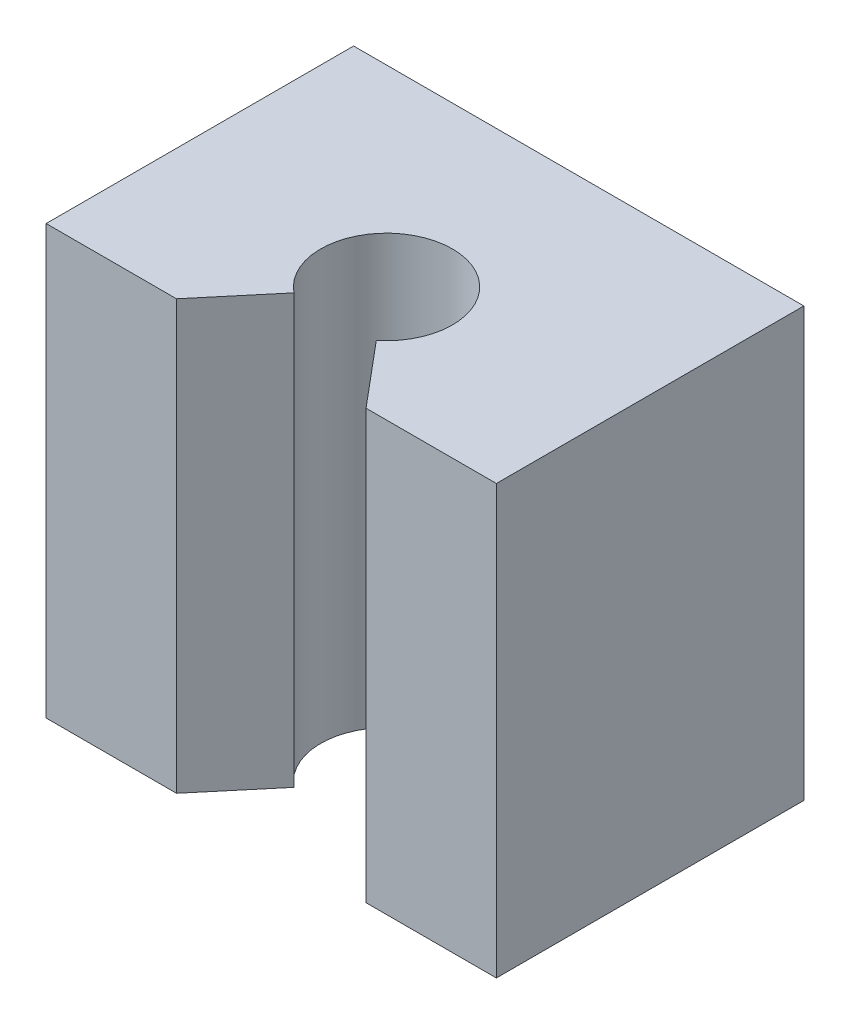
ISO-10303-21;
HEADER;
FILE_DESCRIPTION(('STEP AP214'),'2;1');
FILE_NAME('part.step','',(''),(''),'','','');
FILE_SCHEMA(('AUTOMOTIVE_DESIGN { 1 0 10303 214 1 1 1 1 }'));
ENDSEC;
DATA;
#1=APPLICATION_CONTEXT('core data for automotive mechanical design processes');
#2=APPLICATION_PROTOCOL_DEFINITION('international standard','automotive_design',2000,#1);
#3=PRODUCT_CONTEXT('',#1,'mechanical');
#4=PRODUCT('Part','Part','',(#3));
#5=PRODUCT_RELATED_PRODUCT_CATEGORY('part','',(#4));
#6=PRODUCT_DEFINITION_FORMATION('','',#4);
#7=PRODUCT_DEFINITION_CONTEXT('part definition',#1,'design');
#8=PRODUCT_DEFINITION('design','',#6,#7);
#9=PRODUCT_DEFINITION_SHAPE('','',#8);
#10=(LENGTH_UNIT() NAMED_UNIT(*) SI_UNIT(.MILLI.,.METRE.));
#11=(NAMED_UNIT(*) PLANE_ANGLE_UNIT() SI_UNIT($,.RADIAN.));
#12=(NAMED_UNIT(*) SI_UNIT($,.STERADIAN.) SOLID_ANGLE_UNIT());
#13=UNCERTAINTY_MEASURE_WITH_UNIT(LENGTH_MEASURE(1.E-05),#10,'distance_accuracy_value','');
#14=(GEOMETRIC_REPRESENTATION_CONTEXT(3) GLOBAL_UNCERTAINTY_ASSIGNED_CONTEXT((#13)) GLOBAL_UNIT_ASSIGNED_CONTEXT((#10,
#11,#12)) REPRESENTATION_CONTEXT('',''));
#15=CARTESIAN_POINT('',(0.,0.,0.));
#16=DIRECTION('',(0.,0.,1.));
#17=DIRECTION('',(1.,0.,0.));
#18=AXIS2_PLACEMENT_3D('',#15,#16,#17);
#19=CARTESIAN_POINT('',(0.,39.,0.));
#20=DIRECTION('',(0.,1.,0.));
#21=DIRECTION('',(0.,0.,1.));
#22=AXIS2_PLACEMENT_3D('',#19,#20,#21);
#23=PLANE('',#22);
#24=CARTESIAN_POINT('',(0.,39.,0.));
#25=DIRECTION('',(0.,1.,0.));
#26=DIRECTION('',(0.,0.,1.));
#27=AXIS2_PLACEMENT_3D('',#24,#25,#26);
#28=CIRCLE('',#27,6.);
#29=CARTESIAN_POINT('',(3.75,39.,4.6837484987988));
#30=VERTEX_POINT('',#29);
#31=CARTESIAN_POINT('',(-3.75,39.,4.6837484987988));
#32=VERTEX_POINT('',#31);
#33=EDGE_CURVE('E144',#30,#32,#28,.T.);
#34=ORIENTED_EDGE('',*,*,#33,.F.);
#35=DIRECTION('',(0.64278760968654,0.,0.766044443118977));
#36=VECTOR('',#35,1.);
#37=CARTESIAN_POINT('',(-0.105705584262686,39.,0.0886975167681986));
#38=LINE('',#37,#36);
#39=CARTESIAN_POINT('',(8.63041448949224,39.,10.5));
#40=VERTEX_POINT('',#39);
#41=EDGE_CURVE('E154',#30,#40,#38,.T.);
#42=ORIENTED_EDGE('',*,*,#41,.T.);
#43=DIRECTION('',(1.,0.,0.));
#44=VECTOR('',#43,1.);
#45=CARTESIAN_POINT('',(20.5,39.,10.5));
#46=LINE('',#45,#44);
#47=CARTESIAN_POINT('',(20.5,39.,10.5));
#48=VERTEX_POINT('',#47);
#49=EDGE_CURVE('E150',#40,#48,#46,.T.);
#50=ORIENTED_EDGE('',*,*,#49,.T.);
#51=DIRECTION('',(0.,0.,-1.));
#52=VECTOR('',#51,1.);
#53=CARTESIAN_POINT('',(20.5,39.,10.5));
#54=LINE('',#53,#52);
#55=CARTESIAN_POINT('',(20.5,39.,-17.5));
#56=VERTEX_POINT('',#55);
#57=EDGE_CURVE('E146',#48,#56,#54,.T.);
#58=ORIENTED_EDGE('',*,*,#57,.T.);
#59=DIRECTION('',(-1.,0.,0.));
#60=VECTOR('',#59,1.);
#61=CARTESIAN_POINT('',(20.5,39.,-17.5));
#62=LINE('',#61,#60);
#63=CARTESIAN_POINT('',(-20.5,39.,-17.5));
#64=VERTEX_POINT('',#63);
#65=EDGE_CURVE('E137',#56,#64,#62,.T.);
#66=ORIENTED_EDGE('',*,*,#65,.T.);
#67=DIRECTION('',(0.,0.,1.));
#68=VECTOR('',#67,1.);
#69=CARTESIAN_POINT('',(-20.5,39.,10.5));
#70=LINE('',#69,#68);
#71=CARTESIAN_POINT('',(-20.5,39.,10.5));
#72=VERTEX_POINT('',#71);
#73=EDGE_CURVE('E140',#64,#72,#70,.T.);
#74=ORIENTED_EDGE('',*,*,#73,.T.);
#75=CARTESIAN_POINT('',(-8.63041448949224,39.,10.5));
#76=VERTEX_POINT('',#75);
#77=EDGE_CURVE('E148',#72,#76,#46,.T.);
#78=ORIENTED_EDGE('',*,*,#77,.T.);
#79=DIRECTION('',(0.64278760968654,0.,-0.766044443118977));
#80=VECTOR('',#79,1.);
#81=CARTESIAN_POINT('',(0.105705584262686,39.,0.0886975167681986));
#82=LINE('',#81,#80);
#83=EDGE_CURVE('E54',#76,#32,#82,.T.);
#84=ORIENTED_EDGE('',*,*,#83,.T.);
#85=EDGE_LOOP('',(#34,#42,#50,#58,#66,#74,#78,#84));
#86=FACE_BOUND('',#85,.T.);
#87=ADVANCED_FACE('F39',(#86),#23,.T.);
#88=CARTESIAN_POINT('',(0.,0.,0.));
#89=DIRECTION('',(0.,1.,0.));
#90=DIRECTION('',(0.,0.,1.));
#91=AXIS2_PLACEMENT_3D('',#88,#89,#90);
#92=PLANE('',#91);
#93=DIRECTION('',(0.64278760968654,0.,0.766044443118977));
#94=VECTOR('',#93,1.);
#95=CARTESIAN_POINT('',(-0.105705584262686,0.,0.0886975167681986));
#96=LINE('',#95,#94);
#97=CARTESIAN_POINT('',(3.75,0.,4.6837484987988));
#98=VERTEX_POINT('',#97);
#99=CARTESIAN_POINT('',(8.63041448949224,0.,10.5));
#100=VERTEX_POINT('',#99);
#101=EDGE_CURVE('E158',#98,#100,#96,.T.);
#102=ORIENTED_EDGE('',*,*,#101,.F.);
#103=CARTESIAN_POINT('',(0.,0.,0.));
#104=DIRECTION('',(0.,1.,0.));
#105=DIRECTION('',(0.,0.,1.));
#106=AXIS2_PLACEMENT_3D('',#103,#104,#105);
#107=CIRCLE('',#106,6.);
#108=CARTESIAN_POINT('',(-3.75,0.,4.6837484987988));
#109=VERTEX_POINT('',#108);
#110=EDGE_CURVE('E121',#98,#109,#107,.T.);
#111=ORIENTED_EDGE('',*,*,#110,.T.);
#112=DIRECTION('',(0.64278760968654,0.,-0.766044443118977));
#113=VECTOR('',#112,1.);
#114=CARTESIAN_POINT('',(0.105705584262686,0.,0.0886975167681986));
#115=LINE('',#114,#113);
#116=CARTESIAN_POINT('',(-8.63041448949224,0.,10.5));
#117=VERTEX_POINT('',#116);
#118=EDGE_CURVE('E119',#117,#109,#115,.T.);
#119=ORIENTED_EDGE('',*,*,#118,.F.);
#120=DIRECTION('',(1.,0.,0.));
#121=VECTOR('',#120,1.);
#122=CARTESIAN_POINT('',(20.5,0.,10.5));
#123=LINE('',#122,#121);
#124=CARTESIAN_POINT('',(-20.5,0.,10.5));
#125=VERTEX_POINT('',#124);
#126=EDGE_CURVE('E105',#125,#117,#123,.T.);
#127=ORIENTED_EDGE('',*,*,#126,.F.);
#128=DIRECTION('',(0.,0.,1.));
#129=VECTOR('',#128,1.);
#130=CARTESIAN_POINT('',(-20.5,0.,10.5));
#131=LINE('',#130,#129);
#132=CARTESIAN_POINT('',(-20.5,0.,-17.5));
#133=VERTEX_POINT('',#132);
#134=EDGE_CURVE('E142',#133,#125,#131,.T.);
#135=ORIENTED_EDGE('',*,*,#134,.F.);
#136=DIRECTION('',(-1.,0.,0.));
#137=VECTOR('',#136,1.);
#138=CARTESIAN_POINT('',(20.5,0.,-17.5));
#139=LINE('',#138,#137);
#140=CARTESIAN_POINT('',(20.5,0.,-17.5));
#141=VERTEX_POINT('',#140);
#142=EDGE_CURVE('E138',#141,#133,#139,.T.);
#143=ORIENTED_EDGE('',*,*,#142,.F.);
#144=DIRECTION('',(0.,0.,-1.));
#145=VECTOR('',#144,1.);
#146=CARTESIAN_POINT('',(20.5,0.,10.5));
#147=LINE('',#146,#145);
#148=CARTESIAN_POINT('',(20.5,0.,10.5));
#149=VERTEX_POINT('',#148);
#150=EDGE_CURVE('E114',#149,#141,#147,.T.);
#151=ORIENTED_EDGE('',*,*,#150,.F.);
#152=EDGE_CURVE('E115',#100,#149,#123,.T.);
#153=ORIENTED_EDGE('',*,*,#152,.F.);
#154=EDGE_LOOP('',(#102,#111,#119,#127,#135,#143,#151,#153));
#155=FACE_BOUND('',#154,.T.);
#156=ADVANCED_FACE('F120',(#155),#92,.F.);
#157=CARTESIAN_POINT('',(20.5,39.,10.5));
#158=DIRECTION('',(0.,0.,-1.));
#159=DIRECTION('',(-1.,0.,0.));
#160=AXIS2_PLACEMENT_3D('',#157,#158,#159);
#161=PLANE('',#160);
#162=DIRECTION('',(0.,1.,0.));
#163=VECTOR('',#162,1.);
#164=CARTESIAN_POINT('',(8.63041448949224,39.,10.5));
#165=LINE('',#164,#163);
#166=EDGE_CURVE('E11',#100,#40,#165,.T.);
#167=ORIENTED_EDGE('',*,*,#166,.F.);
#168=ORIENTED_EDGE('',*,*,#152,.T.);
#169=DIRECTION('',(0.,-1.,0.));
#170=VECTOR('',#169,1.);
#171=CARTESIAN_POINT('',(20.5,39.,10.5));
#172=LINE('',#171,#170);
#173=EDGE_CURVE('E126',#48,#149,#172,.T.);
#174=ORIENTED_EDGE('',*,*,#173,.F.);
#175=ORIENTED_EDGE('',*,*,#49,.F.);
#176=EDGE_LOOP('',(#167,#168,#174,#175));
#177=FACE_BOUND('',#176,.T.);
#178=ADVANCED_FACE('F228',(#177),#161,.F.);
#179=DIRECTION('',(0.,-1.,0.));
#180=VECTOR('',#179,1.);
#181=CARTESIAN_POINT('',(-8.63041448949224,39.,10.5));
#182=LINE('',#181,#180);
#183=EDGE_CURVE('E47',#76,#117,#182,.T.);
#184=ORIENTED_EDGE('',*,*,#183,.F.);
#185=ORIENTED_EDGE('',*,*,#77,.F.);
#186=DIRECTION('',(0.,-1.,0.));
#187=VECTOR('',#186,1.);
#188=CARTESIAN_POINT('',(-20.5,39.,10.5));
#189=LINE('',#188,#187);
#190=EDGE_CURVE('E110',#72,#125,#189,.T.);
#191=ORIENTED_EDGE('',*,*,#190,.T.);
#192=ORIENTED_EDGE('',*,*,#126,.T.);
#193=EDGE_LOOP('',(#184,#185,#191,#192));
#194=FACE_BOUND('',#193,.T.);
#195=ADVANCED_FACE('F107',(#194),#161,.F.);
#196=CARTESIAN_POINT('',(-20.5,39.,10.5));
#197=DIRECTION('',(1.,0.,0.));
#198=DIRECTION('',(0.,0.,-1.));
#199=AXIS2_PLACEMENT_3D('',#196,#197,#198);
#200=PLANE('',#199);
#201=ORIENTED_EDGE('',*,*,#134,.T.);
#202=ORIENTED_EDGE('',*,*,#190,.F.);
#203=ORIENTED_EDGE('',*,*,#73,.F.);
#204=DIRECTION('',(0.,-1.,0.));
#205=VECTOR('',#204,1.);
#206=CARTESIAN_POINT('',(-20.5,39.,-17.5));
#207=LINE('',#206,#205);
#208=EDGE_CURVE('E134',#64,#133,#207,.T.);
#209=ORIENTED_EDGE('',*,*,#208,.T.);
#210=EDGE_LOOP('',(#201,#202,#203,#209));
#211=FACE_BOUND('',#210,.T.);
#212=ADVANCED_FACE('F41',(#211),#200,.F.);
#213=CARTESIAN_POINT('',(20.5,39.,10.5));
#214=DIRECTION('',(-1.,0.,0.));
#215=DIRECTION('',(0.,0.,1.));
#216=AXIS2_PLACEMENT_3D('',#213,#214,#215);
#217=PLANE('',#216);
#218=ORIENTED_EDGE('',*,*,#150,.T.);
#219=DIRECTION('',(0.,-1.,0.));
#220=VECTOR('',#219,1.);
#221=CARTESIAN_POINT('',(20.5,39.,-17.5));
#222=LINE('',#221,#220);
#223=EDGE_CURVE('E131',#56,#141,#222,.T.);
#224=ORIENTED_EDGE('',*,*,#223,.F.);
#225=ORIENTED_EDGE('',*,*,#57,.F.);
#226=ORIENTED_EDGE('',*,*,#173,.T.);
#227=EDGE_LOOP('',(#218,#224,#225,#226));
#228=FACE_BOUND('',#227,.T.);
#229=ADVANCED_FACE('F196',(#228),#217,.F.);
#230=CARTESIAN_POINT('',(20.5,39.,-17.5));
#231=DIRECTION('',(0.,0.,1.));
#232=DIRECTION('',(1.,0.,0.));
#233=AXIS2_PLACEMENT_3D('',#230,#231,#232);
#234=PLANE('',#233);
#235=CARTESIAN_POINT('',(-14.,6.50000000000001,-17.5));
#236=DIRECTION('',(0.,0.,-1.));
#237=DIRECTION('',(-1.,0.,0.));
#238=AXIS2_PLACEMENT_3D('',#235,#236,#237);
#239=CIRCLE('',#238,2.5);
#240=CARTESIAN_POINT('',(-16.5,6.50000000000001,-17.5));
#241=VERTEX_POINT('',#240);
#242=EDGE_CURVE('E175',#241,#241,#239,.T.);
#243=ORIENTED_EDGE('',*,*,#242,.F.);
#244=EDGE_LOOP('',(#243));
#245=FACE_BOUND('',#244,.T.);
#246=CARTESIAN_POINT('',(14.,32.5,-17.5));
#247=DIRECTION('',(0.,0.,-1.));
#248=DIRECTION('',(-1.,0.,0.));
#249=AXIS2_PLACEMENT_3D('',#246,#247,#248);
#250=CIRCLE('',#249,2.5);
#251=CARTESIAN_POINT('',(11.5,32.5,-17.5));
#252=VERTEX_POINT('',#251);
#253=EDGE_CURVE('E181',#252,#252,#250,.T.);
#254=ORIENTED_EDGE('',*,*,#253,.F.);
#255=EDGE_LOOP('',(#254));
#256=FACE_BOUND('',#255,.T.);
#257=CARTESIAN_POINT('',(14.,6.50000000000001,-17.5));
#258=DIRECTION('',(0.,0.,-1.));
#259=DIRECTION('',(-1.,0.,0.));
#260=AXIS2_PLACEMENT_3D('',#257,#258,#259);
#261=CIRCLE('',#260,2.5);
#262=CARTESIAN_POINT('',(11.5,6.50000000000001,-17.5));
#263=VERTEX_POINT('',#262);
#264=EDGE_CURVE('E169',#263,#263,#261,.T.);
#265=ORIENTED_EDGE('',*,*,#264,.F.);
#266=EDGE_LOOP('',(#265));
#267=FACE_BOUND('',#266,.T.);
#268=CARTESIAN_POINT('',(-14.,32.5,-17.5));
#269=DIRECTION('',(0.,0.,-1.));
#270=DIRECTION('',(-1.,0.,0.));
#271=AXIS2_PLACEMENT_3D('',#268,#269,#270);
#272=CIRCLE('',#271,2.5);
#273=CARTESIAN_POINT('',(-16.5,32.5,-17.5));
#274=VERTEX_POINT('',#273);
#275=EDGE_CURVE('E166',#274,#274,#272,.T.);
#276=ORIENTED_EDGE('',*,*,#275,.F.);
#277=EDGE_LOOP('',(#276));
#278=FACE_BOUND('',#277,.T.);
#279=ORIENTED_EDGE('',*,*,#142,.T.);
#280=ORIENTED_EDGE('',*,*,#208,.F.);
#281=ORIENTED_EDGE('',*,*,#65,.F.);
#282=ORIENTED_EDGE('',*,*,#223,.T.);
#283=EDGE_LOOP('',(#279,#280,#281,#282));
#284=FACE_BOUND('',#283,.T.);
#285=ADVANCED_FACE('F192',(#245,#256,#267,#278,#284),#234,.F.);
#286=CARTESIAN_POINT('',(0.,39.,0.));
#287=DIRECTION('',(0.,-1.,0.));
#288=DIRECTION('',(0.,0.,-1.));
#289=AXIS2_PLACEMENT_3D('',#286,#287,#288);
#290=CYLINDRICAL_SURFACE('',#289,6.);
#291=DIRECTION('',(0.,-1.,0.));
#292=VECTOR('',#291,1.);
#293=CARTESIAN_POINT('',(3.75,117.918470588323,4.6837484987988));
#294=LINE('',#293,#292);
#295=EDGE_CURVE('E61',#30,#98,#294,.T.);
#296=ORIENTED_EDGE('',*,*,#295,.F.);
#297=ORIENTED_EDGE('',*,*,#33,.T.);
#298=DIRECTION('',(0.,-1.,0.));
#299=VECTOR('',#298,1.);
#300=CARTESIAN_POINT('',(-3.75,117.918470588323,4.6837484987988));
#301=LINE('',#300,#299);
#302=EDGE_CURVE('E163',#32,#109,#301,.T.);
#303=ORIENTED_EDGE('',*,*,#302,.T.);
#304=ORIENTED_EDGE('',*,*,#110,.F.);
#305=EDGE_LOOP('',(#296,#297,#303,#304));
#306=FACE_BOUND('',#305,.T.);
#307=ADVANCED_FACE('F195',(#306),#290,.F.);
#308=CARTESIAN_POINT('',(-3.75,117.918470588323,4.6837484987988));
#309=DIRECTION('',(0.766044443118977,0.,0.64278760968654));
#310=DIRECTION('',(0.64278760968654,0.,-0.766044443118977));
#311=AXIS2_PLACEMENT_3D('',#308,#309,#310);
#312=PLANE('',#311);
#313=ORIENTED_EDGE('',*,*,#83,.F.);
#314=ORIENTED_EDGE('',*,*,#183,.T.);
#315=ORIENTED_EDGE('',*,*,#118,.T.);
#316=ORIENTED_EDGE('',*,*,#302,.F.);
#317=EDGE_LOOP('',(#313,#314,#315,#316));
#318=FACE_BOUND('',#317,.T.);
#319=ADVANCED_FACE('F125',(#318),#312,.T.);
#320=CARTESIAN_POINT('',(3.75,117.918470588323,4.6837484987988));
#321=DIRECTION('',(-0.766044443118977,0.,0.64278760968654));
#322=DIRECTION('',(0.64278760968654,0.,0.766044443118977));
#323=AXIS2_PLACEMENT_3D('',#320,#321,#322);
#324=PLANE('',#323);
#325=ORIENTED_EDGE('',*,*,#41,.F.);
#326=ORIENTED_EDGE('',*,*,#295,.T.);
#327=ORIENTED_EDGE('',*,*,#101,.T.);
#328=ORIENTED_EDGE('',*,*,#166,.T.);
#329=EDGE_LOOP('',(#325,#326,#327,#328));
#330=FACE_BOUND('',#329,.T.);
#331=ADVANCED_FACE('F215',(#330),#324,.T.);
#332=CARTESIAN_POINT('',(-14.,32.5,-7.5));
#333=DIRECTION('',(0.,0.,-1.));
#334=DIRECTION('',(-1.,0.,0.));
#335=AXIS2_PLACEMENT_3D('',#332,#333,#334);
#336=CYLINDRICAL_SURFACE('',#335,2.5);
#337=CARTESIAN_POINT('',(-14.,32.5,-7.5));
#338=DIRECTION('',(0.,0.,-1.));
#339=DIRECTION('',(-1.,0.,0.));
#340=AXIS2_PLACEMENT_3D('',#337,#338,#339);
#341=CIRCLE('',#340,2.5);
#342=CARTESIAN_POINT('',(-16.5,32.5,-7.5));
#343=VERTEX_POINT('',#342);
#344=EDGE_CURVE('E165',#343,#343,#341,.T.);
#345=ORIENTED_EDGE('',*,*,#344,.F.);
#346=EDGE_LOOP('',(#345));
#347=FACE_BOUND('',#346,.T.);
#348=ORIENTED_EDGE('',*,*,#275,.T.);
#349=EDGE_LOOP('',(#348));
#350=FACE_BOUND('',#349,.T.);
#351=ADVANCED_FACE('F270',(#347,#350),#336,.F.);
#352=CARTESIAN_POINT('',(-14.,32.5,-7.5));
#353=DIRECTION('',(0.,0.,-1.));
#354=DIRECTION('',(-1.,0.,0.));
#355=AXIS2_PLACEMENT_3D('',#352,#353,#354);
#356=PLANE('',#355);
#357=ORIENTED_EDGE('',*,*,#344,.T.);
#358=EDGE_LOOP('',(#357));
#359=FACE_BOUND('',#358,.T.);
#360=ADVANCED_FACE('F277',(#359),#356,.T.);
#361=CARTESIAN_POINT('',(14.,6.50000000000001,-7.50000000000001));
#362=DIRECTION('',(0.,0.,-1.));
#363=DIRECTION('',(-1.,0.,0.));
#364=AXIS2_PLACEMENT_3D('',#361,#362,#363);
#365=CYLINDRICAL_SURFACE('',#364,2.5);
#366=CARTESIAN_POINT('',(14.,6.50000000000001,-7.50000000000001));
#367=DIRECTION('',(0.,0.,-1.));
#368=DIRECTION('',(-1.,0.,0.));
#369=AXIS2_PLACEMENT_3D('',#366,#367,#368);
#370=CIRCLE('',#369,2.5);
#371=CARTESIAN_POINT('',(11.5,6.50000000000001,-7.50000000000001));
#372=VERTEX_POINT('',#371);
#373=EDGE_CURVE('E184',#372,#372,#370,.T.);
#374=ORIENTED_EDGE('',*,*,#373,.F.);
#375=EDGE_LOOP('',(#374));
#376=FACE_BOUND('',#375,.T.);
#377=ORIENTED_EDGE('',*,*,#264,.T.);
#378=EDGE_LOOP('',(#377));
#379=FACE_BOUND('',#378,.T.);
#380=ADVANCED_FACE('F190',(#376,#379),#365,.F.);
#381=CARTESIAN_POINT('',(14.,6.50000000000001,-7.50000000000001));
#382=DIRECTION('',(0.,0.,-1.));
#383=DIRECTION('',(-1.,0.,0.));
#384=AXIS2_PLACEMENT_3D('',#381,#382,#383);
#385=PLANE('',#384);
#386=ORIENTED_EDGE('',*,*,#373,.T.);
#387=EDGE_LOOP('',(#386));
#388=FACE_BOUND('',#387,.T.);
#389=ADVANCED_FACE('F296',(#388),#385,.T.);
#390=CARTESIAN_POINT('',(14.,32.5,-7.50000000000001));
#391=DIRECTION('',(0.,0.,-1.));
#392=DIRECTION('',(-1.,0.,0.));
#393=AXIS2_PLACEMENT_3D('',#390,#391,#392);
#394=CYLINDRICAL_SURFACE('',#393,2.5);
#395=CARTESIAN_POINT('',(14.,32.5,-7.50000000000001));
#396=DIRECTION('',(0.,0.,-1.));
#397=DIRECTION('',(-1.,0.,0.));
#398=AXIS2_PLACEMENT_3D('',#395,#396,#397);
#399=CIRCLE('',#398,2.5);
#400=CARTESIAN_POINT('',(11.5,32.5,-7.50000000000001));
#401=VERTEX_POINT('',#400);
#402=EDGE_CURVE('E178',#401,#401,#399,.T.);
#403=ORIENTED_EDGE('',*,*,#402,.F.);
#404=EDGE_LOOP('',(#403));
#405=FACE_BOUND('',#404,.T.);
#406=ORIENTED_EDGE('',*,*,#253,.T.);
#407=EDGE_LOOP('',(#406));
#408=FACE_BOUND('',#407,.T.);
#409=ADVANCED_FACE('F306',(#405,#408),#394,.F.);
#410=CARTESIAN_POINT('',(14.,32.5,-7.50000000000001));
#411=DIRECTION('',(0.,0.,-1.));
#412=DIRECTION('',(-1.,0.,0.));
#413=AXIS2_PLACEMENT_3D('',#410,#411,#412);
#414=PLANE('',#413);
#415=ORIENTED_EDGE('',*,*,#402,.T.);
#416=EDGE_LOOP('',(#415));
#417=FACE_BOUND('',#416,.T.);
#418=ADVANCED_FACE('F316',(#417),#414,.T.);
#419=CARTESIAN_POINT('',(-14.,6.50000000000001,-7.5));
#420=DIRECTION('',(0.,0.,-1.));
#421=DIRECTION('',(-1.,0.,0.));
#422=AXIS2_PLACEMENT_3D('',#419,#420,#421);
#423=CYLINDRICAL_SURFACE('',#422,2.5);
#424=CARTESIAN_POINT('',(-14.,6.50000000000001,-7.5));
#425=DIRECTION('',(0.,0.,-1.));
#426=DIRECTION('',(-1.,0.,0.));
#427=AXIS2_PLACEMENT_3D('',#424,#425,#426);
#428=CIRCLE('',#427,2.5);
#429=CARTESIAN_POINT('',(-16.5,6.50000000000001,-7.5));
#430=VERTEX_POINT('',#429);
#431=EDGE_CURVE('E172',#430,#430,#428,.T.);
#432=ORIENTED_EDGE('',*,*,#431,.F.);
#433=EDGE_LOOP('',(#432));
#434=FACE_BOUND('',#433,.T.);
#435=ORIENTED_EDGE('',*,*,#242,.T.);
#436=EDGE_LOOP('',(#435));
#437=FACE_BOUND('',#436,.T.);
#438=ADVANCED_FACE('F326',(#434,#437),#423,.F.);
#439=CARTESIAN_POINT('',(-14.,6.50000000000001,-7.5));
#440=DIRECTION('',(0.,0.,-1.));
#441=DIRECTION('',(-1.,0.,0.));
#442=AXIS2_PLACEMENT_3D('',#439,#440,#441);
#443=PLANE('',#442);
#444=ORIENTED_EDGE('',*,*,#431,.T.);
#445=EDGE_LOOP('',(#444));
#446=FACE_BOUND('',#445,.T.);
#447=ADVANCED_FACE('F336',(#446),#443,.T.);
#448=CLOSED_SHELL('',(#87,#156,#178,#195,#212,#229,#285,#307,#319,#331,#351,#360,#380,#389,#409,
#418,#438,#447));
#449=MANIFOLD_SOLID_BREP('B2',#448);
#450=ADVANCED_BREP_SHAPE_REPRESENTATION('',(#18,#449),#14);
#451=SHAPE_DEFINITION_REPRESENTATION(#9,#450);
ENDSEC;
END-ISO-10303-21;
